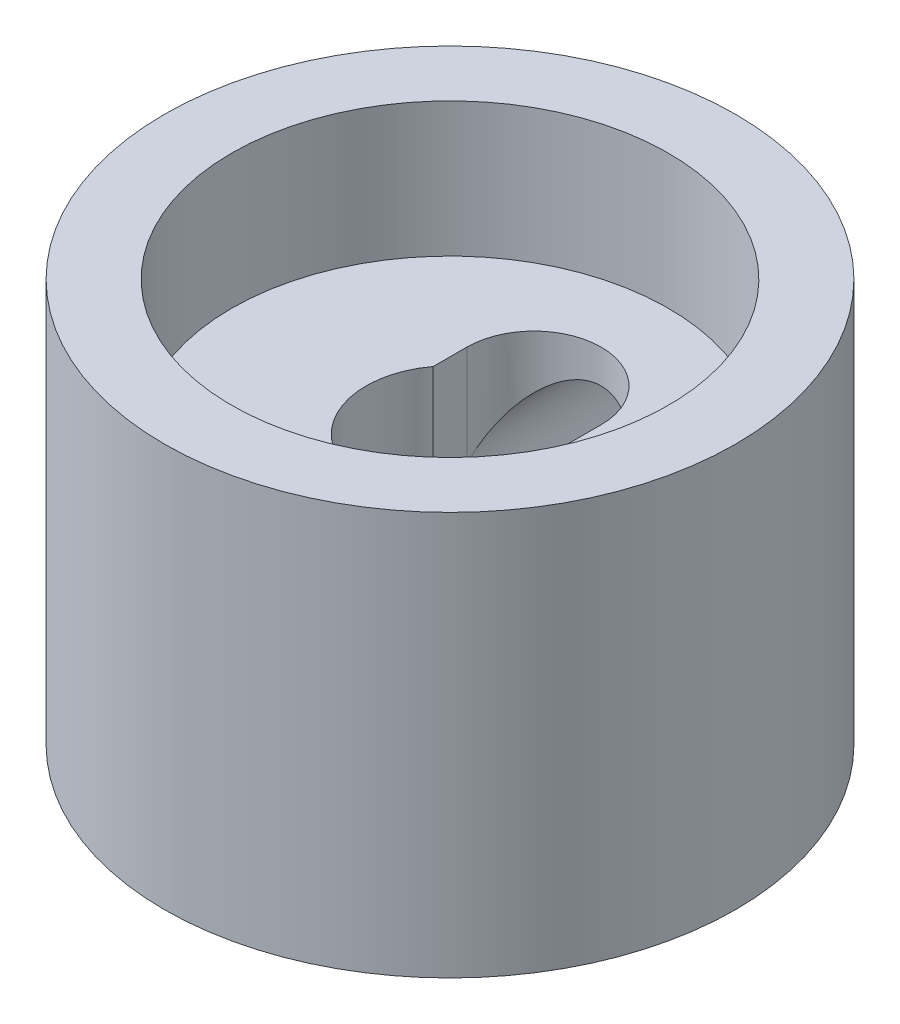
ISO-10303-21;
HEADER;
FILE_DESCRIPTION(('STEP AP214'),'2;1');
FILE_NAME('part.step','',(''),(''),'','','');
FILE_SCHEMA(('AUTOMOTIVE_DESIGN { 1 0 10303 214 1 1 1 1 }'));
ENDSEC;
DATA;
#1=APPLICATION_CONTEXT('core data for automotive mechanical design processes');
#2=APPLICATION_PROTOCOL_DEFINITION('international standard','automotive_design',2000,#1);
#3=PRODUCT_CONTEXT('',#1,'mechanical');
#4=PRODUCT('Part','Part','',(#3));
#5=PRODUCT_RELATED_PRODUCT_CATEGORY('part','',(#4));
#6=PRODUCT_DEFINITION_FORMATION('','',#4);
#7=PRODUCT_DEFINITION_CONTEXT('part definition',#1,'design');
#8=PRODUCT_DEFINITION('design','',#6,#7);
#9=PRODUCT_DEFINITION_SHAPE('','',#8);
#10=(LENGTH_UNIT() NAMED_UNIT(*) SI_UNIT(.MILLI.,.METRE.));
#11=(NAMED_UNIT(*) PLANE_ANGLE_UNIT() SI_UNIT($,.RADIAN.));
#12=(NAMED_UNIT(*) SI_UNIT($,.STERADIAN.) SOLID_ANGLE_UNIT());
#13=UNCERTAINTY_MEASURE_WITH_UNIT(LENGTH_MEASURE(1.E-05),#10,'distance_accuracy_value','');
#14=(GEOMETRIC_REPRESENTATION_CONTEXT(3) GLOBAL_UNCERTAINTY_ASSIGNED_CONTEXT((#13)) GLOBAL_UNIT_ASSIGNED_CONTEXT((#10,
#11,#12)) REPRESENTATION_CONTEXT('',''));
#15=CARTESIAN_POINT('',(0.,0.,0.));
#16=DIRECTION('',(0.,0.,1.));
#17=DIRECTION('',(1.,0.,0.));
#18=AXIS2_PLACEMENT_3D('',#15,#16,#17);
#19=CARTESIAN_POINT('',(0.,34.925,-5.20699999999999));
#20=DIRECTION('',(0.,0.,-1.));
#21=DIRECTION('',(-1.,0.,0.));
#22=AXIS2_PLACEMENT_3D('',#19,#20,#21);
#23=CYLINDRICAL_SURFACE('',#22,12.7);
#24=CARTESIAN_POINT('',(-12.7,34.925,-52.4596094629001));
#25=CARTESIAN_POINT('',(-12.699998345105,34.5736228497792,-52.4596104287949));
#26=CARTESIAN_POINT('',(-12.6854049422105,34.2222113513823,-52.463149395292));
#27=CARTESIAN_POINT('',(-12.6271476613426,33.5219204901763,-52.4772011887384));
#28=CARTESIAN_POINT('',(-12.5834799446439,33.1730414678834,-52.487714936578));
#29=CARTESIAN_POINT('',(-12.4674050254224,32.4801547184368,-52.5154072180193));
#30=CARTESIAN_POINT('',(-12.3949810389231,32.1361499578687,-52.5325896437509));
#31=CARTESIAN_POINT('',(-12.2219905430409,31.4556785733602,-52.5731057782192));
#32=CARTESIAN_POINT('',(-12.1214248744825,31.1192117245245,-52.5964393031706));
#33=CARTESIAN_POINT('',(-11.8930866557179,30.4565368809367,-52.6485403206513));
#34=CARTESIAN_POINT('',(-11.7653471299604,30.1303169804279,-52.677301212541));
#35=CARTESIAN_POINT('',(-11.4835595198571,29.4899059160312,-52.7394471702033));
#36=CARTESIAN_POINT('',(-11.3295112646282,29.1757148302904,-52.7728322660112));
#37=CARTESIAN_POINT('',(-10.9962334639962,28.5614356984751,-52.8432821407687));
#38=CARTESIAN_POINT('',(-10.8170047593466,28.2613471819743,-52.8803467968488));
#39=CARTESIAN_POINT('',(-10.434605536846,27.6771805803608,-52.9571303075936));
#40=CARTESIAN_POINT('',(-10.2314340189865,27.3931031647095,-52.9968492730895));
#41=CARTESIAN_POINT('',(-9.79874855936741,26.8379396579198,-53.0785687086014));
#42=CARTESIAN_POINT('',(-9.56883472632833,26.5671692512551,-53.1205969928267));
#43=CARTESIAN_POINT('',(-9.08718273438936,26.0458642956398,-53.2051078602615));
#44=CARTESIAN_POINT('',(-8.83544433076371,25.7953299736637,-53.2475904485606));
#45=CARTESIAN_POINT('',(-8.31178311731276,25.3161377773906,-53.3318404515298));
#46=CARTESIAN_POINT('',(-8.03985832730302,25.0874820543249,-53.3736077955421));
#47=CARTESIAN_POINT('',(-7.47764103622639,24.6536340009368,-53.4552727261231));
#48=CARTESIAN_POINT('',(-7.18734902418633,24.4484410463267,-53.4951703624235));
#49=CARTESIAN_POINT('',(-6.58662426336751,24.060573060511,-53.5724726166894));
#50=CARTESIAN_POINT('',(-6.27598749971357,23.8782064721413,-53.6098404803727));
#51=CARTESIAN_POINT('',(-5.63997402487552,23.5403454929125,-53.6804776333542));
#52=CARTESIAN_POINT('',(-5.3145971559759,23.3848513896682,-53.713746878784));
#53=CARTESIAN_POINT('',(-4.65142197122044,23.1019625527508,-53.7752337791682));
#54=CARTESIAN_POINT('',(-4.31362490930133,22.9745649915031,-53.8034519423985));
#55=CARTESIAN_POINT('',(-3.62801402089215,22.7488859162057,-53.8540274591908));
#56=CARTESIAN_POINT('',(-3.28020039949836,22.6506038064606,-53.8763849326601));
#57=CARTESIAN_POINT('',(-2.58346586616818,22.4854839115235,-53.9142452641668));
#58=CARTESIAN_POINT('',(-2.2346780602271,22.4181109835973,-53.9298644757109));
#59=CARTESIAN_POINT('',(-1.53245241270722,22.3127981092857,-53.9543847361191));
#60=CARTESIAN_POINT('',(-1.17901462167804,22.2748578432084,-53.9632858579537));
#61=CARTESIAN_POINT('',(-0.470136727476703,22.2287361032861,-53.9741163705415));
#62=CARTESIAN_POINT('',(-0.114696858871914,22.2205512130039,-53.9760465616791));
#63=CARTESIAN_POINT('',(0.595584667802767,22.2340014210744,-53.972882320989));
#64=CARTESIAN_POINT('',(0.950426332368637,22.2556361934957,-53.9677879659401));
#65=CARTESIAN_POINT('',(1.64991568817084,22.3278193244485,-53.9508886807018));
#66=CARTESIAN_POINT('',(1.99462647321568,22.3777895558012,-53.9392179568599));
#67=CARTESIAN_POINT('',(2.67851448713498,22.5057979352951,-53.9095847883014));
#68=CARTESIAN_POINT('',(3.01769180091081,22.5838356523659,-53.8916224402139));
#69=CARTESIAN_POINT('',(3.68817727303018,22.7673619286375,-53.8498914716467));
#70=CARTESIAN_POINT('',(4.0194851847876,22.8728513467967,-53.8261226694855));
#71=CARTESIAN_POINT('',(4.67198117197258,23.1104686878328,-53.773416886081));
#72=CARTESIAN_POINT('',(4.99316911737137,23.2425969528239,-53.7444798384641));
#73=CARTESIAN_POINT('',(5.62588924753895,23.5337035698771,-53.681951296395));
#74=CARTESIAN_POINT('',(5.93732047557385,23.6928935106339,-53.6483235300176));
#75=CARTESIAN_POINT('',(6.54569369768038,24.0362033172449,-53.5774982535011));
#76=CARTESIAN_POINT('',(6.84263564781377,24.220323258692,-53.540300732538));
#77=CARTESIAN_POINT('',(7.42015978383756,24.6122395407823,-53.4633214798233));
#78=CARTESIAN_POINT('',(7.7007398366152,24.8200389581506,-53.4235394125453));
#79=CARTESIAN_POINT('',(8.24371862846315,25.2579038839415,-53.342451166219));
#80=CARTESIAN_POINT('',(8.50611704983053,25.4879697812768,-53.3011449605574));
#81=CARTESIAN_POINT('',(9.01714195054269,25.9746578103262,-53.2171066794494));
#82=CARTESIAN_POINT('',(9.26528544832523,26.2317855455318,-53.1743642033294));
#83=CARTESIAN_POINT('',(9.73909070370638,26.7661022108292,-53.0896286967768));
#84=CARTESIAN_POINT('',(9.96475208667148,27.0432914750859,-53.0476356788423));
#85=CARTESIAN_POINT('',(10.3920491445368,27.6159006585364,-52.9655858730891));
#86=CARTESIAN_POINT('',(10.5936837750601,27.9113213693544,-52.9255291694815));
#87=CARTESIAN_POINT('',(10.9714816814328,28.5184089301474,-52.8485042169568));
#88=CARTESIAN_POINT('',(11.1476450728255,28.8300757064179,-52.8115359540301));
#89=CARTESIAN_POINT('',(11.4738343906892,29.468791500537,-52.7416315372521));
#90=CARTESIAN_POINT('',(11.6237555610741,29.7958958348203,-52.7087116929823));
#91=CARTESIAN_POINT('',(11.8954457862534,30.4620674688444,-52.648061549117));
#92=CARTESIAN_POINT('',(12.0172146910437,30.8011348323169,-52.6203312771732));
#93=CARTESIAN_POINT('',(12.2315906779226,31.4887435957948,-52.5709133117848));
#94=CARTESIAN_POINT('',(12.3242022197755,31.8372835380539,-52.5492246942974));
#95=CARTESIAN_POINT('',(12.4795020492353,32.5413131194913,-52.5125607204827));
#96=CARTESIAN_POINT('',(12.5421910258364,32.8968025984541,-52.4975852095806));
#97=CARTESIAN_POINT('',(12.63598482885,33.6036403705467,-52.4750872439823));
#98=CARTESIAN_POINT('',(12.6677974858884,33.9548895645621,-52.4673978601159));
#99=CARTESIAN_POINT('',(12.702101599642,34.6588983216946,-52.4591036559204));
#100=CARTESIAN_POINT('',(12.7045935135135,35.0116578611772,-52.4584987251335));
#101=CARTESIAN_POINT('',(12.680236315495,35.7160747590465,-52.4643916017761));
#102=CARTESIAN_POINT('',(12.6533893945663,36.0677321977691,-52.4708888788279));
#103=CARTESIAN_POINT('',(12.5705866365734,36.7674031727795,-52.4907876187722));
#104=CARTESIAN_POINT('',(12.5146309041679,37.1154167221641,-52.5041890568412));
#105=CARTESIAN_POINT('',(12.3750747302326,37.8004077947885,-52.5372554061994));
#106=CARTESIAN_POINT('',(12.2918764082611,38.1374717872024,-52.5568290644071));
#107=CARTESIAN_POINT('',(12.0983042518435,38.8033030200704,-52.6017254491026));
#108=CARTESIAN_POINT('',(11.9879307460619,39.1320703608137,-52.62704810606));
#109=CARTESIAN_POINT('',(11.7408392933271,39.7791366459298,-52.6827233893509));
#110=CARTESIAN_POINT('',(11.6041192027106,40.097434736014,-52.7130764249479));
#111=CARTESIAN_POINT('',(11.3053391082479,40.7214631073732,-52.77796215132));
#112=CARTESIAN_POINT('',(11.1432786461883,41.0271931612623,-52.8124949176719));
#113=CARTESIAN_POINT('',(10.7918877018891,41.6293877318342,-52.8854283665174));
#114=CARTESIAN_POINT('',(10.6021277229942,41.9255947096579,-52.9238863959959));
#115=CARTESIAN_POINT('',(10.1988645783552,42.5010550864817,-53.0030753242397));
#116=CARTESIAN_POINT('',(9.98536118280204,42.7803083213487,-53.043806245002));
#117=CARTESIAN_POINT('',(9.5360167415036,43.3201010254435,-53.1264264196388));
#118=CARTESIAN_POINT('',(9.30017283520675,43.5806380906618,-53.1683158213613));
#119=CARTESIAN_POINT('',(8.80771440858819,44.0812798174711,-53.2521094718013));
#120=CARTESIAN_POINT('',(8.55109971101866,44.3213843046646,-53.2940137206424));
#121=CARTESIAN_POINT('',(8.01291578480653,44.7846134522947,-53.3776128938746));
#122=CARTESIAN_POINT('',(7.73092295396667,45.0072507511663,-53.419283110567));
#123=CARTESIAN_POINT('',(7.14886406084473,45.4279851812661,-53.5002868399059));
#124=CARTESIAN_POINT('',(6.84879770361257,45.6260819118443,-53.5396203143972));
#125=CARTESIAN_POINT('',(6.23263671381866,45.9962875867749,-53.614840972598));
#126=CARTESIAN_POINT('',(5.91654257585354,46.168397332401,-53.6507282625535));
#127=CARTESIAN_POINT('',(5.27050171307368,46.4853313117861,-53.7180406606235));
#128=CARTESIAN_POINT('',(4.94055517407515,46.6301559114053,-53.7494658285682));
#129=CARTESIAN_POINT('',(4.27147301338863,46.8904702518654,-53.8067568752565));
#130=CARTESIAN_POINT('',(3.93241720303232,47.0061568943471,-53.832659876851));
#131=CARTESIAN_POINT('',(3.2453640808635,47.2085605437966,-53.8784442667835));
#132=CARTESIAN_POINT('',(2.89736678842772,47.2952776135374,-53.8983256681694));
#133=CARTESIAN_POINT('',(2.19502980236854,47.4390045132694,-53.9314939413737));
#134=CARTESIAN_POINT('',(1.84069101397404,47.4960185488382,-53.94478174675));
#135=CARTESIAN_POINT('',(1.1282710449786,47.5798662580967,-53.964382666163));
#136=CARTESIAN_POINT('',(0.770189936064374,47.6067005088352,-53.9706959135559));
#137=CARTESIAN_POINT('',(0.0616107802343961,47.6296773647528,-53.9760996901044));
#138=CARTESIAN_POINT('',(-0.288862769412321,47.6265418348119,-53.9753600979587));
#139=CARTESIAN_POINT('',(-0.988267749776503,47.5913303194917,-53.9670849254755));
#140=CARTESIAN_POINT('',(-1.33719920676997,47.5592548291511,-53.9595494613864));
#141=CARTESIAN_POINT('',(-2.03100663877382,47.4664316437659,-53.937891144964));
#142=CARTESIAN_POINT('',(-2.37588273131491,47.4056847817712,-53.9237684840227));
#143=CARTESIAN_POINT('',(-3.05914824181565,47.256014844033,-53.8893241268534));
#144=CARTESIAN_POINT('',(-3.39753763131907,47.167091644714,-53.8690024034377));
#145=CARTESIAN_POINT('',(-4.06404074300338,46.962217455468,-53.8228141385453));
#146=CARTESIAN_POINT('',(-4.39219235042873,46.8463841658728,-53.7969717819167));
#147=CARTESIAN_POINT('',(-5.03752243953738,46.5883668181821,-53.740384420382));
#148=CARTESIAN_POINT('',(-5.35470098216254,46.4461829064596,-53.7096394427094));
#149=CARTESIAN_POINT('',(-5.97603128812993,46.1364919520235,-53.6440610353737));
#150=CARTESIAN_POINT('',(-6.28018198631637,45.9689828437756,-53.6092272722795));
#151=CARTESIAN_POINT('',(-6.87348395603668,45.6098245850114,-53.5363912675564));
#152=CARTESIAN_POINT('',(-7.16263485118133,45.4181748291484,-53.4983889464815));
#153=CARTESIAN_POINT('',(-7.73017451521896,45.0076431382023,-53.4193680774975));
#154=CARTESIAN_POINT('',(-8.00819607609142,44.7882625347084,-53.3783021189209));
#155=CARTESIAN_POINT('',(-8.5448622214485,44.327153655927,-53.2950251986403));
#156=CARTESIAN_POINT('',(-8.8035065035044,44.0854250319767,-53.2528142190794));
#157=CARTESIAN_POINT('',(-9.29978307493071,43.5811657318667,-53.168393284183));
#158=CARTESIAN_POINT('',(-9.53741029477122,43.3186300656347,-53.1261833315364));
#159=CARTESIAN_POINT('',(-9.99000169513998,42.77452790861,-53.0429396797099));
#160=CARTESIAN_POINT('',(-10.2049659240982,42.4929614584874,-53.0019059780164));
#161=CARTESIAN_POINT('',(-10.6140283553805,41.9079666700396,-52.9215191401969));
#162=CARTESIAN_POINT('',(-10.8077358600034,41.6042597855216,-52.8822035931673));
#163=CARTESIAN_POINT('',(-11.1688232696384,40.9811573188151,-52.8071210751559));
#164=CARTESIAN_POINT('',(-11.3362033072344,40.6617618156443,-52.7713540863042));
#165=CARTESIAN_POINT('',(-11.6432559452158,40.0097192528399,-52.7044580815017));
#166=CARTESIAN_POINT('',(-11.7829472743267,39.6770813345549,-52.6733259341025));
#167=CARTESIAN_POINT('',(-12.0336355792697,39.0007372630075,-52.6166207900639));
#168=CARTESIAN_POINT('',(-12.1446373098456,38.6570329544163,-52.5910468723677));
#169=CARTESIAN_POINT('',(-12.3168132840437,38.0342515809257,-52.5509541788993));
#170=CARTESIAN_POINT('',(-12.383556751976,37.7567758985717,-52.5352415721182));
#171=CARTESIAN_POINT('',(-12.4982368908381,37.1977657183753,-52.508077325953));
#172=CARTESIAN_POINT('',(-12.5461749372792,36.9162315189531,-52.4966253749289));
#173=CARTESIAN_POINT('',(-12.6229851912924,36.3504010956255,-52.4782091264877));
#174=CARTESIAN_POINT('',(-12.6518556306613,36.0661046180447,-52.4712452452658));
#175=CARTESIAN_POINT('',(-12.6903615003632,35.496212783131,-52.4619455519841));
#176=CARTESIAN_POINT('',(-12.7000013451853,35.2106177389823,-52.4596086777702));
#177=CARTESIAN_POINT('',(-12.7,34.925,-52.4596094629001));
#178=B_SPLINE_CURVE_WITH_KNOTS('',3,(#24,#25,#26,#27,#28,#29,#30,#31,#32,#33,#34,#35,#36,#37,
#38,#39,#40,#41,#42,#43,#44,#45,#46,#47,#48,#49,#50,#51,#52,#53,#54,#55,#56,#57,#58,#59,#60,#61,
#62,#63,#64,#65,#66,#67,#68,#69,#70,#71,#72,#73,#74,#75,#76,#77,#78,#79,#80,#81,#82,#83,#84,#85,
#86,#87,#88,#89,#90,#91,#92,#93,#94,#95,#96,#97,#98,#99,#100,#101,#102,#103,#104,#105,#106,#107,
#108,#109,#110,#111,#112,#113,#114,#115,#116,#117,#118,#119,#120,#121,#122,#123,#124,#125,#126,
#127,#128,#129,#130,#131,#132,#133,#134,#135,#136,#137,#138,#139,#140,#141,#142,#143,#144,#145,
#146,#147,#148,#149,#150,#151,#152,#153,#154,#155,#156,#157,#158,#159,#160,#161,#162,#163,#164,
#165,#166,#167,#168,#169,#170,#171,#172,#173,#174,#175,#176,#177),.UNSPECIFIED.,.T.,.F.,(4,2,2,
2,2,2,2,2,2,2,2,2,2,2,2,2,2,2,2,2,2,2,2,2,2,2,2,2,2,2,2,2,2,2,2,2,2,2,2,2,2,2,2,2,2,2,2,2,2,2,2,
2,2,2,2,2,2,2,2,2,2,2,2,2,2,2,2,2,2,2,2,2,2,2,2,2,4),(0.,1.0538712978583,2.10788176752728,
3.16250833077414,4.21710338697788,5.2704240396268,6.32375153416684,7.37704386736478,
8.43038020854208,9.50221132531275,10.5740544624168,11.6460028813099,12.717922771604,
13.8030439464661,14.8881767346017,15.9732002674587,17.0582015994505,18.1236344773942,
19.1890557826541,20.2543547550644,21.3196420837591,22.3639384816874,23.4082188416276,
24.4525318808291,25.4968583326652,26.5497610517018,27.6026669634307,28.6557098378087,
29.7087711082511,30.7871582809556,31.8655634204943,32.9440154182536,34.0224625237585,
35.1051210814527,36.1877854077595,37.2702840546112,38.3527577747506,39.4097849300209,
40.4667956045636,41.5237273492076,42.5806552937498,43.6226369896024,44.6646060840431,
45.7066599930674,46.7487327470539,47.8091336195509,48.8695447564038,49.9300918557533,
50.9906480062487,52.0744437130641,53.1582571116269,54.2420370854356,55.3258025260531,
56.4020350129383,57.4782651677586,58.5543429004245,59.6304000577294,60.6806054233895,
61.7307928248771,62.7809497149305,63.8311112108162,64.8767631849758,65.9224093508938,
66.9681408462282,68.0138985693634,69.0822374564917,70.1505930141268,71.2192055712015,
72.2878158446447,73.3735935770975,74.4593658414455,75.5444011609895,76.6292565415189,
77.4860782517161,78.3428372785052,79.1996757442767,80.0563174954077),.UNSPECIFIED.);
#179=CARTESIAN_POINT('',(-12.7,34.925,-52.4596094629001));
#180=VERTEX_POINT('',#179);
#181=EDGE_CURVE('E142',#180,#180,#178,.T.);
#182=ORIENTED_EDGE('',*,*,#181,.F.);
#183=EDGE_LOOP('',(#182));
#184=FACE_BOUND('',#183,.T.);
#185=DIRECTION('',(0.,0.,-1.));
#186=VECTOR('',#185,1.);
#187=CARTESIAN_POINT('',(12.7,34.925,-5.20699999999999));
#188=LINE('',#187,#186);
#189=CARTESIAN_POINT('',(12.7,34.925,-15.875));
#190=VERTEX_POINT('',#189);
#191=CARTESIAN_POINT('',(12.7,34.925,-9.525));
#192=VERTEX_POINT('',#191);
#193=EDGE_CURVE('E11',#190,#192,#188,.F.);
#194=ORIENTED_EDGE('',*,*,#193,.F.);
#195=CARTESIAN_POINT('',(0.,34.925,-15.875));
#196=DIRECTION('',(0.,-0.707106781186547,-0.707106781186548));
#197=DIRECTION('',(0.,0.707106781186547,-0.707106781186548));
#198=AXIS2_PLACEMENT_3D('',#195,#196,#197);
#199=ELLIPSE('',#198,17.9605122421383,12.7);
#200=CARTESIAN_POINT('',(-12.7,34.925,-15.875));
#201=VERTEX_POINT('',#200);
#202=EDGE_CURVE('E52',#190,#201,#199,.F.);
#203=ORIENTED_EDGE('',*,*,#202,.T.);
#204=DIRECTION('',(0.,0.,1.));
#205=VECTOR('',#204,1.);
#206=CARTESIAN_POINT('',(-12.7,34.925,-15.875));
#207=LINE('',#206,#205);
#208=CARTESIAN_POINT('',(-12.7,34.925,-9.525));
#209=VERTEX_POINT('',#208);
#210=EDGE_CURVE('E99',#201,#209,#207,.T.);
#211=ORIENTED_EDGE('',*,*,#210,.T.);
#212=CARTESIAN_POINT('',(0.,22.225,-15.875));
#213=CARTESIAN_POINT('',(-0.30494667840836,22.2250024845426,-15.874997577373));
#214=CARTESIAN_POINT('',(-0.609940256039707,22.2360030522032,-15.8661933313083));
#215=CARTESIAN_POINT('',(-1.21747713996693,22.2798195243152,-15.8311732111849));
#216=CARTESIAN_POINT('',(-1.5200190637507,22.312646973619,-15.8049481227586));
#217=CARTESIAN_POINT('',(-2.12065102334586,22.3996219902253,-15.7356292600999));
#218=CARTESIAN_POINT('',(-2.41873141252236,22.4538103096629,-15.6925032433047));
#219=CARTESIAN_POINT('',(-3.00760934021387,22.5825880567023,-15.590356696802));
#220=CARTESIAN_POINT('',(-3.29840768727425,22.6571752083035,-15.5313379403388));
#221=CARTESIAN_POINT('',(-3.86906959192734,22.825074116919,-15.3990641395143));
#222=CARTESIAN_POINT('',(-4.14899129296076,22.918262785137,-15.3259027742938));
#223=CARTESIAN_POINT('',(-4.69839855430973,23.1224177602704,-15.1664928825069));
#224=CARTESIAN_POINT('',(-4.96788404935246,23.2333841783538,-15.0802442741036));
#225=CARTESIAN_POINT('',(-5.49524841470717,23.4717922308836,-14.896169105062));
#226=CARTESIAN_POINT('',(-5.75313016439515,23.5992297474256,-14.7983454387944));
#227=CARTESIAN_POINT('',(-6.25659857364949,23.8693847804679,-14.5926211266803));
#228=CARTESIAN_POINT('',(-6.50218270321687,24.0121054223772,-14.4847184202421));
#229=CARTESIAN_POINT('',(-7.06379319521996,24.3638649467749,-14.2212954576489));
#230=CARTESIAN_POINT('',(-7.37457237616273,24.5786920093292,-14.0622771763875));
#231=CARTESIAN_POINT('',(-7.9719735898551,25.0316556475675,-13.7324350357982));
#232=CARTESIAN_POINT('',(-8.25858785176862,25.269799668598,-13.5616074107762));
#233=CARTESIAN_POINT('',(-8.80794766725593,25.7681465779495,-13.2114362349412));
#234=CARTESIAN_POINT('',(-9.07062785966304,26.0284063288144,-13.0320712876853));
#235=CARTESIAN_POINT('',(-9.57101847600514,26.5690859725293,-12.6691256086766));
#236=CARTESIAN_POINT('',(-9.80873173491323,26.8495035703696,-12.4855453584587));
#237=CARTESIAN_POINT('',(-10.2625205316581,27.4343515667554,-12.1154170639607));
#238=CARTESIAN_POINT('',(-10.4781992973685,27.7390890433773,-11.9288675290394));
#239=CARTESIAN_POINT('',(-10.8831695998757,28.3685705849906,-11.5605858255578));
#240=CARTESIAN_POINT('',(-11.07245279467,28.693320928263,-11.3788551945831));
#241=CARTESIAN_POINT('',(-11.4230949312855,29.3621746760682,-11.0267876923303));
#242=CARTESIAN_POINT('',(-11.584529491996,29.7062222003306,-10.8564207625562));
#243=CARTESIAN_POINT('',(-11.8782406284372,30.4145220148165,-10.5342528672376));
#244=CARTESIAN_POINT('',(-12.010542115611,30.7787567069062,-10.3824360894564));
#245=CARTESIAN_POINT('',(-12.2609502301359,31.5840580433012,-10.0860255233747));
#246=CARTESIAN_POINT('',(-12.3739822665681,32.0284730182819,-9.94590029857912));
#247=CARTESIAN_POINT('',(-12.5077685491712,32.7115070426839,-9.77632497404277));
#248=CARTESIAN_POINT('',(-12.5463874066265,32.9417337160113,-9.72659169933256));
#249=CARTESIAN_POINT('',(-12.6111097368224,33.4067898126652,-9.64252902120893));
#250=CARTESIAN_POINT('',(-12.6372133620519,33.641619179875,-9.60819943011341));
#251=CARTESIAN_POINT('',(-12.6764877884261,34.1163630031023,-9.55632598629623));
#252=CARTESIAN_POINT('',(-12.6895407068897,34.3563041630678,-9.53893517157742));
#253=CARTESIAN_POINT('',(-12.701973065163,34.8371683319256,-9.52237455445031));
#254=CARTESIAN_POINT('',(-12.701353179672,35.0780912917833,-9.52320385295076));
#255=CARTESIAN_POINT('',(-12.6864510417179,35.5589264040324,-9.54304635018706));
#256=CARTESIAN_POINT('',(-12.6721588774248,35.7988376962623,-9.56207274105107));
#257=CARTESIAN_POINT('',(-12.6302598416232,36.2754839924495,-9.61734609800038));
#258=CARTESIAN_POINT('',(-12.6026511086837,36.5122185475962,-9.65359547155657));
#259=CARTESIAN_POINT('',(-12.5294118697671,37.017561341775,-9.74851742136451));
#260=CARTESIAN_POINT('',(-12.4816382149726,37.2853644113476,-9.80981014988176));
#261=CARTESIAN_POINT('',(-12.3702320643353,37.8129251812563,-9.94992273330006));
#262=CARTESIAN_POINT('',(-12.3065961455702,38.0726811314827,-10.0287463708047));
#263=CARTESIAN_POINT('',(-12.1644148141591,38.5839056122715,-10.2007400930584));
#264=CARTESIAN_POINT('',(-12.0858329517356,38.835352080579,-10.2939451436955));
#265=CARTESIAN_POINT('',(-11.9148315022644,39.3289792676996,-10.4914007945581));
#266=CARTESIAN_POINT('',(-11.8224108090249,39.5711592438609,-10.5956522775733));
#267=CARTESIAN_POINT('',(-11.5758866538451,40.1629535255003,-10.8656452878137));
#268=CARTESIAN_POINT('',(-11.4137761571934,40.5069405786077,-11.036447721227));
#269=CARTESIAN_POINT('',(-11.0621800181692,41.1748553143252,-11.3888481317532));
#270=CARTESIAN_POINT('',(-10.8726817236956,41.498773626605,-11.5704510753392));
#271=CARTESIAN_POINT('',(-10.4670632421006,42.1271214407239,-11.9386489698189));
#272=CARTESIAN_POINT('',(-10.2509122011905,42.4315277238644,-12.1252495067597));
#273=CARTESIAN_POINT('',(-9.79269564292254,43.0201960463812,-12.4982409972812));
#274=CARTESIAN_POINT('',(-9.55063438695703,43.3044613855493,-12.6846319802469));
#275=CARTESIAN_POINT('',(-9.03396923050786,43.8594812008788,-13.0578441998883));
#276=CARTESIAN_POINT('',(-8.75866725097097,44.1296697173602,-13.2445431943891));
#277=CARTESIAN_POINT('',(-8.18114501817286,44.6465755594696,-13.6088599474267));
#278=CARTESIAN_POINT('',(-7.87892080737872,44.8932894232939,-13.7864763647761));
#279=CARTESIAN_POINT('',(-7.24878360602118,45.3604494502225,-14.1279475031629));
#280=CARTESIAN_POINT('',(-6.92093102408309,45.5809544692505,-14.2918328053372));
#281=CARTESIAN_POINT('',(-6.23998049869099,45.9934651554294,-14.6019884722184));
#282=CARTESIAN_POINT('',(-5.88689405571919,46.1854836842743,-14.7482667808474));
#283=CARTESIAN_POINT('',(-5.26225278489996,46.4870941008431,-14.9800275385172));
#284=CARTESIAN_POINT('',(-4.99644491560532,46.6045115412655,-15.0708975016188));
#285=CARTESIAN_POINT('',(-4.45395465520634,46.8219586774891,-15.2400320119973));
#286=CARTESIAN_POINT('',(-4.17727498446519,46.9219926894608,-15.3182996879688));
#287=CARTESIAN_POINT('',(-3.614471953031,47.1033807245021,-15.4607707934911));
#288=CARTESIAN_POINT('',(-3.32835336626695,47.1847440298969,-15.5249812110128));
#289=CARTESIAN_POINT('',(-2.74821885639655,47.3276822502214,-15.6381022375529));
#290=CARTESIAN_POINT('',(-2.45420272825256,47.3892566508482,-15.6870124489265));
#291=CARTESIAN_POINT('',(-1.85875128032138,47.4918925464473,-15.7686854465922));
#292=CARTESIAN_POINT('',(-1.55728497388172,47.532843967524,-15.8013615722343));
#293=CARTESIAN_POINT('',(-0.95081240513036,47.5930229322973,-15.849419579856));
#294=CARTESIAN_POINT('',(-0.645806148732399,47.6122505122797,-15.8648014907225));
#295=CARTESIAN_POINT('',(-0.0348642398977805,47.6286275313694,-15.8779014160869));
#296=CARTESIAN_POINT('',(0.271071274905032,47.6257800945265,-15.8756219300206));
#297=CARTESIAN_POINT('',(0.881287902046764,47.5980660531953,-15.8534588686467));
#298=CARTESIAN_POINT('',(1.18556909819186,47.5732005747765,-15.8335761936198));
#299=CARTESIAN_POINT('',(1.76540064594875,47.5048073231654,-15.778998494928));
#300=CARTESIAN_POINT('',(2.04127806471699,47.4629584575826,-15.7456369955863));
#301=CARTESIAN_POINT('',(2.58771032088186,47.3616780067708,-15.665109040232));
#302=CARTESIAN_POINT('',(2.85826550153526,47.3022475594538,-15.6179434776458));
#303=CARTESIAN_POINT('',(3.3925464131602,47.1665938109041,-15.5106583287495));
#304=CARTESIAN_POINT('',(3.65627079588138,47.0903672222848,-15.450536206597));
#305=CARTESIAN_POINT('',(4.17553455360404,46.9220586693609,-15.3183657070138));
#306=CARTESIAN_POINT('',(4.43107347466708,46.8299758275204,-15.2463166695182));
#307=CARTESIAN_POINT('',(4.94835701794503,46.6248236828428,-15.0866529321878));
#308=CARTESIAN_POINT('',(5.20951546128384,46.5108114889903,-14.9983531018737));
#309=CARTESIAN_POINT('',(5.72055257441212,46.2671978611628,-14.8109761888023));
#310=CARTESIAN_POINT('',(5.97042662496108,46.137590121329,-14.7118947481989));
#311=CARTESIAN_POINT('',(6.45802479405754,45.8640146826235,-14.5044721605462));
#312=CARTESIAN_POINT('',(6.69575310640763,45.7200519917509,-14.3961342446701));
#313=CARTESIAN_POINT('',(7.15871987604545,45.4187614646917,-14.1716111753516));
#314=CARTESIAN_POINT('',(7.3839566151059,45.2614317973641,-14.0554249472177));
#315=CARTESIAN_POINT('',(7.86303164748492,44.9033908833232,-13.794064569784));
#316=CARTESIAN_POINT('',(8.11422305881236,44.7001024544214,-13.647563813091));
#317=CARTESIAN_POINT('',(8.59823116839439,44.2772045622588,-13.3479242119325));
#318=CARTESIAN_POINT('',(8.83104576228436,44.0575932354062,-13.1947846103416));
#319=CARTESIAN_POINT('',(9.27874690133013,43.6023874066791,-12.8839022841866));
#320=CARTESIAN_POINT('',(9.49358271322574,43.3667508654809,-12.7261481237307));
#321=CARTESIAN_POINT('',(9.90448653437382,42.8806547058261,-12.4090345784905));
#322=CARTESIAN_POINT('',(10.1005531456873,42.6301939855023,-12.249675075115));
#323=CARTESIAN_POINT('',(10.5135528372191,42.059727449868,-11.8982821593991));
#324=CARTESIAN_POINT('',(10.7260095611716,41.7362868638651,-11.7065335629652));
#325=CARTESIAN_POINT('',(11.1223556700039,41.0678220117483,-11.3306415398359));
#326=CARTESIAN_POINT('',(11.3062299005031,40.7227864310659,-11.1465021852711));
#327=CARTESIAN_POINT('',(11.6432760906933,40.0120735241968,-10.7939325356038));
#328=CARTESIAN_POINT('',(11.7965539751738,39.6464732349201,-10.625449161936));
#329=CARTESIAN_POINT('',(12.070692152685,38.8934383378949,-10.312962009102));
#330=CARTESIAN_POINT('',(12.1915924323626,38.506031384249,-10.1689281158875));
#331=CARTESIAN_POINT('',(12.3499941726961,37.8942707640339,-9.97501858225638));
#332=CARTESIAN_POINT('',(12.4002315732214,37.6771995152859,-9.91236969987972));
#333=CARTESIAN_POINT('',(12.4896683580783,37.2376678513625,-9.79943847253189));
#334=CARTESIAN_POINT('',(12.5288722182286,37.0152096613186,-9.74915111408885));
#335=CARTESIAN_POINT('',(12.5955394814601,36.5662695374559,-9.66286672759351));
#336=CARTESIAN_POINT('',(12.6230273532485,36.3397970288163,-9.62683992786805));
#337=CARTESIAN_POINT('',(12.6658301367698,35.8837418586098,-9.57045641501676));
#338=CARTESIAN_POINT('',(12.6811451298122,35.6541592178278,-9.55009959722224));
#339=CARTESIAN_POINT('',(12.6992991565703,35.1923593820623,-9.52594684638087));
#340=CARTESIAN_POINT('',(12.7020696433642,34.9601346469261,-9.52224190496048));
#341=CARTESIAN_POINT('',(12.6948802261925,34.4962445671537,-9.53182425962114));
#342=CARTESIAN_POINT('',(12.6849205432783,34.2645792128741,-9.54511126064795));
#343=CARTESIAN_POINT('',(12.6524873721715,33.80335450168,-9.58806046021301));
#344=CARTESIAN_POINT('',(12.6299967311097,33.5737984708647,-9.61774510401326));
#345=CARTESIAN_POINT('',(12.5729788396098,33.1186673025756,-9.69216225956366));
#346=CARTESIAN_POINT('',(12.5384497292991,32.8930927858831,-9.73689709644269));
#347=CARTESIAN_POINT('',(12.4469453592656,32.3859243592538,-9.85373460854014));
#348=CARTESIAN_POINT('',(12.3864116765365,32.1059256979748,-9.92997795162857));
#349=CARTESIAN_POINT('',(12.2481923852876,31.5556752544723,-10.0999691950349));
#350=CARTESIAN_POINT('',(12.1705011277289,31.2854267165965,-10.1937228589592));
#351=CARTESIAN_POINT('',(11.9990053841559,30.7546465582668,-10.3950472597565));
#352=CARTESIAN_POINT('',(11.9051624789839,30.494139951483,-10.5026507831025));
#353=CARTESIAN_POINT('',(11.702490708543,29.9836292052541,-10.7280159748945));
#354=CARTESIAN_POINT('',(11.5936612525631,29.7336254802984,-10.8457780436822));
#355=CARTESIAN_POINT('',(11.3090850631601,29.1327785363077,-11.1435931232852));
#356=CARTESIAN_POINT('',(11.125386044233,28.787670768012,-11.3276582403771));
#357=CARTESIAN_POINT('',(10.7292417243535,28.1187885603139,-11.7035758817964));
#358=CARTESIAN_POINT('',(10.5167847311749,27.7950228780661,-11.8954315512295));
#359=CARTESIAN_POINT('',(10.0636628337192,27.1685679479255,-12.2811620495433));
#360=CARTESIAN_POINT('',(9.82297127640276,26.86589905172,-12.4750386262881));
#361=CARTESIAN_POINT('',(9.31393241288701,26.2826364256931,-12.8595507170032));
#362=CARTESIAN_POINT('',(9.04558947818796,26.0020392188139,-13.0501867377493));
#363=CARTESIAN_POINT('',(8.4776983769123,25.4606170720182,-13.4261593651769));
#364=CARTESIAN_POINT('',(8.1777844345715,25.2001027194294,-13.6113925362028));
#365=CARTESIAN_POINT('',(7.55007024437262,24.7051088087522,-13.9693450754672));
#366=CARTESIAN_POINT('',(7.22226538358843,24.470633572158,-14.1420623649018));
#367=CARTESIAN_POINT('',(6.54049083719444,24.0311453732755,-14.4699812896572));
#368=CARTESIAN_POINT('',(6.1865863396617,23.8260625370709,-14.6252242709722));
#369=CARTESIAN_POINT('',(5.45366365285546,23.4481854181498,-14.9140221714579));
#370=CARTESIAN_POINT('',(5.07466102771949,23.275371373896,-15.047590357753));
#371=CARTESIAN_POINT('',(4.4218935551712,23.0163143138429,-15.2492021285262));
#372=CARTESIAN_POINT('',(4.15419225001359,22.9202321311998,-15.3243975998438));
#373=CARTESIAN_POINT('',(3.60990702456853,22.7455010308983,-15.4616586999103));
#374=CARTESIAN_POINT('',(3.33332548263745,22.6668474892627,-15.5237278110022));
#375=CARTESIAN_POINT('',(2.77338166478295,22.5281706985372,-15.6334644268157));
#376=CARTESIAN_POINT('',(2.49003537416441,22.4681074637805,-15.6811628353447));
#377=CARTESIAN_POINT('',(1.91790207054162,22.3672950473085,-15.7613654907325));
#378=CARTESIAN_POINT('',(1.62911753910614,22.3265372680589,-15.7938765010919));
#379=CARTESIAN_POINT('',(1.11689347436992,22.2722413256298,-15.8372262104825));
#380=CARTESIAN_POINT('',(0.894161916845499,22.25454431787,-15.8513728529898));
#381=CARTESIAN_POINT('',(0.447628812993453,22.2309214336566,-15.870261683122));
#382=CARTESIAN_POINT('',(0.223827039684141,22.2249981763769,-15.8750017781779));
#383=CARTESIAN_POINT('',(0.,22.225,-15.875));
#384=B_SPLINE_CURVE_WITH_KNOTS('',3,(#212,#213,#214,#215,#216,#217,#218,#219,#220,#221,#222,
#223,#224,#225,#226,#227,#228,#229,#230,#231,#232,#233,#234,#235,#236,#237,#238,#239,#240,#241,
#242,#243,#244,#245,#246,#247,#248,#249,#250,#251,#252,#253,#254,#255,#256,#257,#258,#259,#260,
#261,#262,#263,#264,#265,#266,#267,#268,#269,#270,#271,#272,#273,#274,#275,#276,#277,#278,#279,
#280,#281,#282,#283,#284,#285,#286,#287,#288,#289,#290,#291,#292,#293,#294,#295,#296,#297,#298,
#299,#300,#301,#302,#303,#304,#305,#306,#307,#308,#309,#310,#311,#312,#313,#314,#315,#316,#317,
#318,#319,#320,#321,#322,#323,#324,#325,#326,#327,#328,#329,#330,#331,#332,#333,#334,#335,#336,
#337,#338,#339,#340,#341,#342,#343,#344,#345,#346,#347,#348,#349,#350,#351,#352,#353,#354,#355,
#356,#357,#358,#359,#360,#361,#362,#363,#364,#365,#366,#367,#368,#369,#370,#371,#372,#373,#374,
#375,#376,#377,#378,#379,#380,#381,#382,#383),.UNSPECIFIED.,.T.,.F.,(4,2,2,2,2,2,2,2,2,2,2,2,2,
2,2,2,2,2,2,2,2,2,2,2,2,2,2,2,2,2,2,2,2,2,2,2,2,2,2,2,2,2,2,2,2,2,2,2,2,2,2,2,2,2,2,2,2,2,2,2,2,
2,2,2,2,2,2,2,2,2,2,2,2,2,2,2,2,2,2,2,2,2,2,2,2,4),(0.,0.914599258605317,1.82968265976217,
2.74652036673165,3.66325581919473,4.57411502389516,5.4849799246074,6.39561754081386,
7.30644173991964,8.534412674094,9.76277699885103,10.9944011502385,12.2258853002592,
13.4766388088149,14.727786711439,15.9754819190094,17.2221060539484,18.6549958358645,
19.3703218639848,20.0856391761674,20.8073608704842,21.5290469507415,22.2512566200067,
22.9735672712298,23.8088380449222,24.6442892181998,25.4818046178244,26.3193869991027,
27.5681742563058,28.8175402597801,30.0683663787264,31.3189870924095,32.6031112936639,
33.8874245719843,35.1687969424603,36.4495889989859,37.362127021439,38.2744381430318,
39.1862947127533,40.0981749792143,41.0148720915901,41.931567672777,42.8481335258397,
43.7646525056411,44.6067670924613,45.4488271880012,46.2910522404585,47.1333239193329,
48.0274392710664,48.921917369417,49.8160844965834,50.7103743137501,51.7737939024171,
52.8373350891695,53.9037827646834,54.9703098080289,56.2644417620996,57.5592575390624,
58.8495097932902,60.138161147473,60.8319627661149,61.525482533169,62.2175467093315,
62.9096062627653,63.6054429078757,64.30126747039,64.9980468533552,65.6949339323732,
66.5828642159623,67.4710872828072,68.3614530844829,69.2518539909383,70.5464038244324,
71.8414815772394,73.1377918555262,74.4338975092231,75.7471452311459,77.0606105771145,
78.3708997297698,79.6803838053386,80.5621267663998,81.4436355121804,82.3232348396134,
83.2024420751669,83.8735971795784,84.5449015716099),.UNSPECIFIED.);
#385=CARTESIAN_POINT('',(0.,22.225,-15.875));
#386=VERTEX_POINT('',#385);
#387=EDGE_CURVE('E151',#386,#209,#384,.T.);
#388=ORIENTED_EDGE('',*,*,#387,.F.);
#389=EDGE_CURVE('E67',#192,#386,#384,.T.);
#390=ORIENTED_EDGE('',*,*,#389,.F.);
#391=EDGE_LOOP('',(#194,#203,#211,#388,#390));
#392=FACE_BOUND('',#391,.T.);
#393=ADVANCED_FACE('F43',(#184,#392),#23,.F.);
#394=CARTESIAN_POINT('',(0.,0.,0.));
#395=DIRECTION('',(0.,1.,0.));
#396=DIRECTION('',(-1.,0.,0.));
#397=AXIS2_PLACEMENT_3D('',#394,#395,#396);
#398=PLANE('',#397);
#399=CARTESIAN_POINT('',(0.,0.,0.));
#400=DIRECTION('',(0.,1.,0.));
#401=DIRECTION('',(-1.,0.,0.));
#402=AXIS2_PLACEMENT_3D('',#399,#400,#401);
#403=CIRCLE('',#402,12.7);
#404=CARTESIAN_POINT('',(-12.7,0.,0.));
#405=VERTEX_POINT('',#404);
#406=EDGE_CURVE('E109',#405,#405,#403,.T.);
#407=ORIENTED_EDGE('',*,*,#406,.F.);
#408=EDGE_LOOP('',(#407));
#409=FACE_BOUND('',#408,.T.);
#410=ADVANCED_FACE('F45',(#409),#398,.F.);
#411=CARTESIAN_POINT('',(0.,22.225,0.));
#412=DIRECTION('',(0.,1.,0.));
#413=DIRECTION('',(-1.,0.,0.));
#414=AXIS2_PLACEMENT_3D('',#411,#412,#413);
#415=CYLINDRICAL_SURFACE('',#414,12.7);
#416=CARTESIAN_POINT('',(0.,3.175,0.));
#417=DIRECTION('',(0.,1.,0.));
#418=DIRECTION('',(-1.,0.,0.));
#419=AXIS2_PLACEMENT_3D('',#416,#417,#418);
#420=CIRCLE('',#419,12.7);
#421=CARTESIAN_POINT('',(-12.7,3.175,0.));
#422=VERTEX_POINT('',#421);
#423=EDGE_CURVE('E112',#422,#422,#420,.T.);
#424=ORIENTED_EDGE('',*,*,#423,.F.);
#425=EDGE_LOOP('',(#424));
#426=FACE_BOUND('',#425,.T.);
#427=ORIENTED_EDGE('',*,*,#406,.T.);
#428=EDGE_LOOP('',(#427));
#429=FACE_BOUND('',#428,.T.);
#430=ADVANCED_FACE('F199',(#426,#429),#415,.T.);
#431=CARTESIAN_POINT('',(12.7,3.175,0.));
#432=DIRECTION('',(0.,1.,0.));
#433=DIRECTION('',(-1.,0.,0.));
#434=AXIS2_PLACEMENT_3D('',#431,#432,#433);
#435=PLANE('',#434);
#436=CARTESIAN_POINT('',(0.,3.175,0.));
#437=DIRECTION('',(0.,1.,0.));
#438=DIRECTION('',(-1.,0.,0.));
#439=AXIS2_PLACEMENT_3D('',#436,#437,#438);
#440=CIRCLE('',#439,53.975);
#441=CARTESIAN_POINT('',(-53.975,3.175,0.));
#442=VERTEX_POINT('',#441);
#443=EDGE_CURVE('E118',#442,#442,#440,.T.);
#444=ORIENTED_EDGE('',*,*,#443,.F.);
#445=EDGE_LOOP('',(#444));
#446=FACE_BOUND('',#445,.T.);
#447=ORIENTED_EDGE('',*,*,#423,.T.);
#448=EDGE_LOOP('',(#447));
#449=FACE_BOUND('',#448,.T.);
#450=ADVANCED_FACE('F188',(#446,#449),#435,.F.);
#451=CARTESIAN_POINT('',(0.,22.225,0.));
#452=DIRECTION('',(0.,1.,0.));
#453=DIRECTION('',(-1.,0.,0.));
#454=AXIS2_PLACEMENT_3D('',#451,#452,#453);
#455=CYLINDRICAL_SURFACE('',#454,53.975);
#456=ORIENTED_EDGE('',*,*,#181,.T.);
#457=EDGE_LOOP('',(#456));
#458=FACE_BOUND('',#457,.T.);
#459=CARTESIAN_POINT('',(0.,79.375,0.));
#460=DIRECTION('',(0.,1.,0.));
#461=DIRECTION('',(-1.,0.,0.));
#462=AXIS2_PLACEMENT_3D('',#459,#460,#461);
#463=CIRCLE('',#462,53.975);
#464=CARTESIAN_POINT('',(-53.975,79.375,0.));
#465=VERTEX_POINT('',#464);
#466=EDGE_CURVE('E122',#465,#465,#463,.T.);
#467=ORIENTED_EDGE('',*,*,#466,.F.);
#468=EDGE_LOOP('',(#467));
#469=FACE_BOUND('',#468,.T.);
#470=ORIENTED_EDGE('',*,*,#443,.T.);
#471=EDGE_LOOP('',(#470));
#472=FACE_BOUND('',#471,.T.);
#473=ADVANCED_FACE('F157',(#458,#469,#472),#455,.T.);
#474=CARTESIAN_POINT('',(53.975,79.375,0.));
#475=DIRECTION('',(0.,-1.,0.));
#476=DIRECTION('',(1.,0.,0.));
#477=AXIS2_PLACEMENT_3D('',#474,#475,#476);
#478=PLANE('',#477);
#479=CARTESIAN_POINT('',(0.,79.375,0.));
#480=DIRECTION('',(0.,1.,0.));
#481=DIRECTION('',(-1.,0.,0.));
#482=AXIS2_PLACEMENT_3D('',#479,#480,#481);
#483=CIRCLE('',#482,41.275);
#484=CARTESIAN_POINT('',(-41.275,79.375,0.));
#485=VERTEX_POINT('',#484);
#486=EDGE_CURVE('E126',#485,#485,#483,.T.);
#487=ORIENTED_EDGE('',*,*,#486,.F.);
#488=EDGE_LOOP('',(#487));
#489=FACE_BOUND('',#488,.T.);
#490=ORIENTED_EDGE('',*,*,#466,.T.);
#491=EDGE_LOOP('',(#490));
#492=FACE_BOUND('',#491,.T.);
#493=ADVANCED_FACE('F181',(#489,#492),#478,.F.);
#494=CARTESIAN_POINT('',(0.,22.225,0.));
#495=DIRECTION('',(0.,1.,0.));
#496=DIRECTION('',(-1.,0.,0.));
#497=AXIS2_PLACEMENT_3D('',#494,#495,#496);
#498=CYLINDRICAL_SURFACE('',#497,41.275);
#499=CARTESIAN_POINT('',(0.,53.975,0.));
#500=DIRECTION('',(0.,1.,0.));
#501=DIRECTION('',(-1.,0.,0.));
#502=AXIS2_PLACEMENT_3D('',#499,#500,#501);
#503=CIRCLE('',#502,41.275);
#504=CARTESIAN_POINT('',(-41.275,53.975,0.));
#505=VERTEX_POINT('',#504);
#506=EDGE_CURVE('E130',#505,#505,#503,.T.);
#507=ORIENTED_EDGE('',*,*,#506,.F.);
#508=EDGE_LOOP('',(#507));
#509=FACE_BOUND('',#508,.T.);
#510=ORIENTED_EDGE('',*,*,#486,.T.);
#511=EDGE_LOOP('',(#510));
#512=FACE_BOUND('',#511,.T.);
#513=ADVANCED_FACE('F178',(#509,#512),#498,.F.);
#514=CARTESIAN_POINT('',(41.275,53.975,0.));
#515=DIRECTION('',(0.,-1.,0.));
#516=DIRECTION('',(1.,0.,0.));
#517=AXIS2_PLACEMENT_3D('',#514,#515,#516);
#518=PLANE('',#517);
#519=CARTESIAN_POINT('',(0.,53.975,-15.875));
#520=DIRECTION('',(0.,1.,0.));
#521=DIRECTION('',(-1.,0.,0.));
#522=AXIS2_PLACEMENT_3D('',#519,#520,#521);
#523=CIRCLE('',#522,12.7);
#524=CARTESIAN_POINT('',(12.7,53.975,-15.875));
#525=VERTEX_POINT('',#524);
#526=CARTESIAN_POINT('',(-12.7,53.975,-15.875));
#527=VERTEX_POINT('',#526);
#528=EDGE_CURVE('E95',#525,#527,#523,.T.);
#529=ORIENTED_EDGE('',*,*,#528,.F.);
#530=DIRECTION('',(0.,0.,-1.));
#531=VECTOR('',#530,1.);
#532=CARTESIAN_POINT('',(12.7,53.975,0.));
#533=LINE('',#532,#531);
#534=CARTESIAN_POINT('',(12.7,53.975,-9.525));
#535=VERTEX_POINT('',#534);
#536=EDGE_CURVE('E105',#535,#525,#533,.T.);
#537=ORIENTED_EDGE('',*,*,#536,.F.);
#538=CARTESIAN_POINT('',(0.,53.975,0.));
#539=DIRECTION('',(0.,1.,0.));
#540=DIRECTION('',(-1.,0.,0.));
#541=AXIS2_PLACEMENT_3D('',#538,#539,#540);
#542=CIRCLE('',#541,15.875);
#543=CARTESIAN_POINT('',(-12.7,53.975,-9.52500000000001));
#544=VERTEX_POINT('',#543);
#545=EDGE_CURVE('E134',#544,#535,#542,.T.);
#546=ORIENTED_EDGE('',*,*,#545,.F.);
#547=DIRECTION('',(0.,0.,1.));
#548=VECTOR('',#547,1.);
#549=CARTESIAN_POINT('',(-12.7,53.975,-15.875));
#550=LINE('',#549,#548);
#551=EDGE_CURVE('E291',#527,#544,#550,.T.);
#552=ORIENTED_EDGE('',*,*,#551,.F.);
#553=EDGE_LOOP('',(#529,#537,#546,#552));
#554=FACE_BOUND('',#553,.T.);
#555=ORIENTED_EDGE('',*,*,#506,.T.);
#556=EDGE_LOOP('',(#555));
#557=FACE_BOUND('',#556,.T.);
#558=ADVANCED_FACE('F175',(#554,#557),#518,.F.);
#559=CARTESIAN_POINT('',(0.,22.225,0.));
#560=DIRECTION('',(0.,1.,0.));
#561=DIRECTION('',(-1.,0.,0.));
#562=AXIS2_PLACEMENT_3D('',#559,#560,#561);
#563=CYLINDRICAL_SURFACE('',#562,15.875);
#564=ORIENTED_EDGE('',*,*,#545,.T.);
#565=DIRECTION('',(0.,1.,0.));
#566=VECTOR('',#565,1.);
#567=CARTESIAN_POINT('',(12.7,22.225,-9.52500000000001));
#568=LINE('',#567,#566);
#569=EDGE_CURVE('E288',#535,#192,#568,.F.);
#570=ORIENTED_EDGE('',*,*,#569,.T.);
#571=ORIENTED_EDGE('',*,*,#389,.T.);
#572=CARTESIAN_POINT('',(0.,22.225,0.));
#573=DIRECTION('',(0.,1.,0.));
#574=DIRECTION('',(-1.,0.,0.));
#575=AXIS2_PLACEMENT_3D('',#572,#573,#574);
#576=CIRCLE('',#575,15.875);
#577=EDGE_CURVE('E138',#386,#386,#576,.T.);
#578=ORIENTED_EDGE('',*,*,#577,.F.);
#579=ORIENTED_EDGE('',*,*,#387,.T.);
#580=DIRECTION('',(0.,1.,0.));
#581=VECTOR('',#580,1.);
#582=CARTESIAN_POINT('',(-12.7,22.225,-9.52500000000001));
#583=LINE('',#582,#581);
#584=EDGE_CURVE('E59',#209,#544,#583,.T.);
#585=ORIENTED_EDGE('',*,*,#584,.T.);
#586=EDGE_LOOP('',(#564,#570,#571,#578,#579,#585));
#587=FACE_BOUND('',#586,.T.);
#588=ADVANCED_FACE('F170',(#587),#563,.F.);
#589=CARTESIAN_POINT('',(15.875,22.225,0.));
#590=DIRECTION('',(0.,-1.,0.));
#591=DIRECTION('',(1.,0.,0.));
#592=AXIS2_PLACEMENT_3D('',#589,#590,#591);
#593=PLANE('',#592);
#594=ORIENTED_EDGE('',*,*,#577,.T.);
#595=EDGE_LOOP('',(#594));
#596=FACE_BOUND('',#595,.T.);
#597=ADVANCED_FACE('F167',(#596),#593,.F.);
#598=CARTESIAN_POINT('',(0.,34.925,-15.875));
#599=DIRECTION('',(0.,1.,0.));
#600=DIRECTION('',(-1.,0.,0.));
#601=AXIS2_PLACEMENT_3D('',#598,#599,#600);
#602=CYLINDRICAL_SURFACE('',#601,12.7);
#603=DIRECTION('',(0.,1.,0.));
#604=VECTOR('',#603,1.);
#605=CARTESIAN_POINT('',(12.7,34.925,-15.875));
#606=LINE('',#605,#604);
#607=EDGE_CURVE('E98',#190,#525,#606,.T.);
#608=ORIENTED_EDGE('',*,*,#607,.T.);
#609=ORIENTED_EDGE('',*,*,#528,.T.);
#610=DIRECTION('',(0.,1.,0.));
#611=VECTOR('',#610,1.);
#612=CARTESIAN_POINT('',(-12.7,34.925,-15.875));
#613=LINE('',#612,#611);
#614=EDGE_CURVE('E89',#201,#527,#613,.T.);
#615=ORIENTED_EDGE('',*,*,#614,.F.);
#616=ORIENTED_EDGE('',*,*,#202,.F.);
#617=EDGE_LOOP('',(#608,#609,#615,#616));
#618=FACE_BOUND('',#617,.T.);
#619=ADVANCED_FACE('F91',(#618),#602,.F.);
#620=CARTESIAN_POINT('',(12.7,34.925,0.));
#621=DIRECTION('',(1.,0.,0.));
#622=DIRECTION('',(0.,0.,-1.));
#623=AXIS2_PLACEMENT_3D('',#620,#621,#622);
#624=PLANE('',#623);
#625=ORIENTED_EDGE('',*,*,#536,.T.);
#626=ORIENTED_EDGE('',*,*,#607,.F.);
#627=ORIENTED_EDGE('',*,*,#193,.T.);
#628=ORIENTED_EDGE('',*,*,#569,.F.);
#629=EDGE_LOOP('',(#625,#626,#627,#628));
#630=FACE_BOUND('',#629,.T.);
#631=ADVANCED_FACE('F263',(#630),#624,.F.);
#632=CARTESIAN_POINT('',(-12.7,34.925,-15.875));
#633=DIRECTION('',(-1.,0.,0.));
#634=DIRECTION('',(0.,0.,1.));
#635=AXIS2_PLACEMENT_3D('',#632,#633,#634);
#636=PLANE('',#635);
#637=ORIENTED_EDGE('',*,*,#210,.F.);
#638=ORIENTED_EDGE('',*,*,#614,.T.);
#639=ORIENTED_EDGE('',*,*,#551,.T.);
#640=ORIENTED_EDGE('',*,*,#584,.F.);
#641=EDGE_LOOP('',(#637,#638,#639,#640));
#642=FACE_BOUND('',#641,.T.);
#643=ADVANCED_FACE('F101',(#642),#636,.F.);
#644=CLOSED_SHELL('',(#393,#410,#430,#450,#473,#493,#513,#558,#588,#597,#619,#631,#643));
#645=MANIFOLD_SOLID_BREP('B2',#644);
#646=ADVANCED_BREP_SHAPE_REPRESENTATION('',(#18,#645),#14);
#647=SHAPE_DEFINITION_REPRESENTATION(#9,#646);
ENDSEC;
END-ISO-10303-21;
